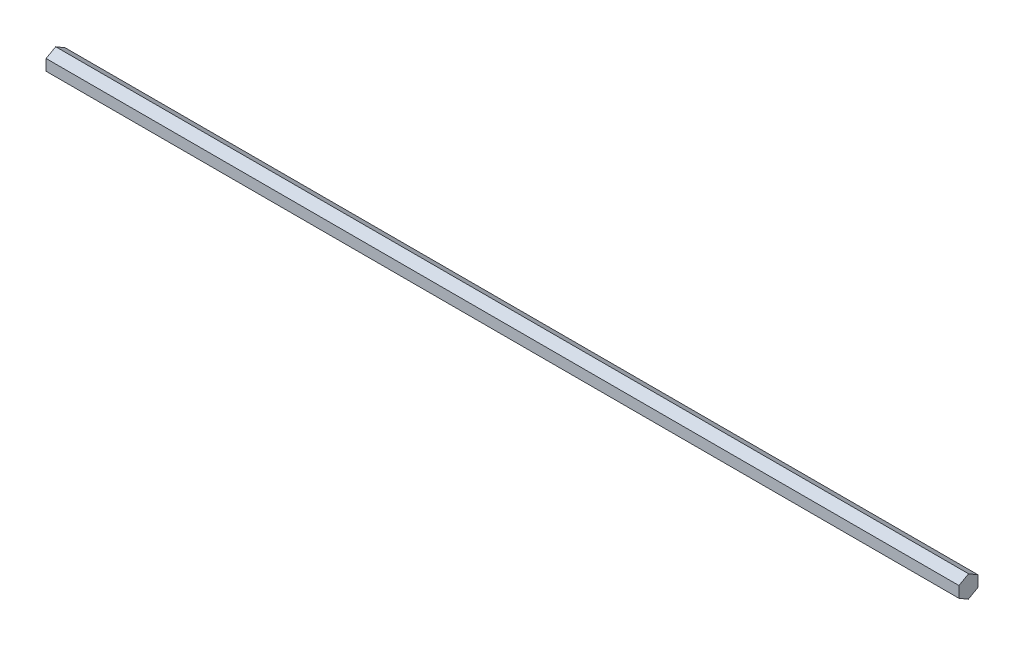
ISO-10303-21;
HEADER;
FILE_DESCRIPTION(('STEP AP214'),'2;1');
FILE_NAME('part.step','',(''),(''),'','','');
FILE_SCHEMA(('AUTOMOTIVE_DESIGN { 1 0 10303 214 1 1 1 1 }'));
ENDSEC;
DATA;
#1=APPLICATION_CONTEXT('core data for automotive mechanical design processes');
#2=APPLICATION_PROTOCOL_DEFINITION('international standard','automotive_design',2000,#1);
#3=PRODUCT_CONTEXT('',#1,'mechanical');
#4=PRODUCT('Part','Part','',(#3));
#5=PRODUCT_RELATED_PRODUCT_CATEGORY('part','',(#4));
#6=PRODUCT_DEFINITION_FORMATION('','',#4);
#7=PRODUCT_DEFINITION_CONTEXT('part definition',#1,'design');
#8=PRODUCT_DEFINITION('design','',#6,#7);
#9=PRODUCT_DEFINITION_SHAPE('','',#8);
#10=(LENGTH_UNIT() NAMED_UNIT(*) SI_UNIT(.MILLI.,.METRE.));
#11=(NAMED_UNIT(*) PLANE_ANGLE_UNIT() SI_UNIT($,.RADIAN.));
#12=(NAMED_UNIT(*) SI_UNIT($,.STERADIAN.) SOLID_ANGLE_UNIT());
#13=UNCERTAINTY_MEASURE_WITH_UNIT(LENGTH_MEASURE(1.E-05),#10,'distance_accuracy_value','');
#14=(GEOMETRIC_REPRESENTATION_CONTEXT(3) GLOBAL_UNCERTAINTY_ASSIGNED_CONTEXT((#13)) GLOBAL_UNIT_ASSIGNED_CONTEXT((#10,
#11,#12)) REPRESENTATION_CONTEXT('',''));
#15=CARTESIAN_POINT('',(0.,0.,0.));
#16=DIRECTION('',(0.,0.,1.));
#17=DIRECTION('',(1.,0.,0.));
#18=AXIS2_PLACEMENT_3D('',#15,#16,#17);
#19=CARTESIAN_POINT('',(609.6,-3.7307506345818,-6.31227637512022));
#20=DIRECTION('',(0.,0.0101995476622231,0.999947983260872));
#21=DIRECTION('',(0.,-0.999947983260872,0.0101995476622231));
#22=AXIS2_PLACEMENT_3D('',#19,#20,#21);
#23=PLANE('',#22);
#24=DIRECTION('',(0.,0.999947983260872,-0.0101995476622231));
#25=VECTOR('',#24,1.);
#26=CARTESIAN_POINT('',(0.,-3.7307506345818,-6.31227637512022));
#27=LINE('',#26,#25);
#28=CARTESIAN_POINT('',(0.,-3.7307506345818,-6.31227637512022));
#29=VERTEX_POINT('',#28);
#30=CARTESIAN_POINT('',(0.,3.60121637927156,-6.38706301229286));
#31=VERTEX_POINT('',#30);
#32=EDGE_CURVE('E116',#29,#31,#27,.T.);
#33=ORIENTED_EDGE('',*,*,#32,.T.);
#34=DIRECTION('',(-1.,0.,0.));
#35=VECTOR('',#34,1.);
#36=CARTESIAN_POINT('',(609.6,3.60121637927156,-6.38706301229286));
#37=LINE('',#36,#35);
#38=CARTESIAN_POINT('',(609.6,3.60121637927156,-6.38706301229286));
#39=VERTEX_POINT('',#38);
#40=EDGE_CURVE('E11',#39,#31,#37,.T.);
#41=ORIENTED_EDGE('',*,*,#40,.F.);
#42=DIRECTION('',(0.,0.999947983260872,-0.0101995476622231));
#43=VECTOR('',#42,1.);
#44=CARTESIAN_POINT('',(609.6,-3.7307506345818,-6.31227637512022));
#45=LINE('',#44,#43);
#46=CARTESIAN_POINT('',(609.6,-3.7307506345818,-6.31227637512022));
#47=VERTEX_POINT('',#46);
#48=EDGE_CURVE('E126',#47,#39,#45,.T.);
#49=ORIENTED_EDGE('',*,*,#48,.F.);
#50=DIRECTION('',(-1.,0.,0.));
#51=VECTOR('',#50,1.);
#52=CARTESIAN_POINT('',(609.6,-3.7307506345818,-6.31227637512022));
#53=LINE('',#52,#51);
#54=EDGE_CURVE('E112',#47,#29,#53,.T.);
#55=ORIENTED_EDGE('',*,*,#54,.T.);
#56=EDGE_LOOP('',(#33,#41,#49,#55));
#57=FACE_BOUND('',#56,.T.);
#58=ADVANCED_FACE('F32',(#57),#23,.F.);
#59=CARTESIAN_POINT('',(609.6,3.60121637927156,-6.38706301229286));
#60=DIRECTION('',(0.,-0.86088058213582,0.508807059013032));
#61=DIRECTION('',(0.,-0.508807059013032,-0.86088058213582));
#62=AXIS2_PLACEMENT_3D('',#59,#60,#61);
#63=PLANE('',#62);
#64=DIRECTION('',(0.,0.508807059013032,0.86088058213582));
#65=VECTOR('',#64,1.);
#66=CARTESIAN_POINT('',(0.,3.60121637927156,-6.38706301229286));
#67=LINE('',#66,#65);
#68=CARTESIAN_POINT('',(0.,7.33196701385336,-0.0747866371726431));
#69=VERTEX_POINT('',#68);
#70=EDGE_CURVE('E119',#31,#69,#67,.T.);
#71=ORIENTED_EDGE('',*,*,#70,.T.);
#72=DIRECTION('',(-1.,0.,0.));
#73=VECTOR('',#72,1.);
#74=CARTESIAN_POINT('',(609.6,7.33196701385336,-0.0747866371726431));
#75=LINE('',#74,#73);
#76=CARTESIAN_POINT('',(609.6,7.33196701385336,-0.0747866371726431));
#77=VERTEX_POINT('',#76);
#78=EDGE_CURVE('E40',#77,#69,#75,.T.);
#79=ORIENTED_EDGE('',*,*,#78,.F.);
#80=DIRECTION('',(0.,0.508807059013032,0.86088058213582));
#81=VECTOR('',#80,1.);
#82=CARTESIAN_POINT('',(609.6,3.60121637927156,-6.38706301229286));
#83=LINE('',#82,#81);
#84=EDGE_CURVE('E85',#39,#77,#83,.T.);
#85=ORIENTED_EDGE('',*,*,#84,.F.);
#86=ORIENTED_EDGE('',*,*,#40,.T.);
#87=EDGE_LOOP('',(#71,#79,#85,#86));
#88=FACE_BOUND('',#87,.T.);
#89=ADVANCED_FACE('F150',(#88),#63,.F.);
#90=CARTESIAN_POINT('',(609.6,7.33196701385336,-0.0747866371726431));
#91=DIRECTION('',(0.,-0.871080129798044,-0.491140924247841));
#92=DIRECTION('',(0.,0.491140924247841,-0.871080129798044));
#93=AXIS2_PLACEMENT_3D('',#90,#91,#92);
#94=PLANE('',#93);
#95=DIRECTION('',(0.,-0.49114092424784,0.871080129798044));
#96=VECTOR('',#95,1.);
#97=CARTESIAN_POINT('',(0.,7.33196701385336,-0.0747866371726431));
#98=LINE('',#97,#96);
#99=CARTESIAN_POINT('',(0.,3.7307506345818,6.31227637512022));
#100=VERTEX_POINT('',#99);
#101=EDGE_CURVE('E121',#69,#100,#98,.T.);
#102=ORIENTED_EDGE('',*,*,#101,.T.);
#103=DIRECTION('',(-1.,0.,0.));
#104=VECTOR('',#103,1.);
#105=CARTESIAN_POINT('',(609.6,3.7307506345818,6.31227637512022));
#106=LINE('',#105,#104);
#107=CARTESIAN_POINT('',(609.6,3.7307506345818,6.31227637512022));
#108=VERTEX_POINT('',#107);
#109=EDGE_CURVE('E107',#108,#100,#106,.T.);
#110=ORIENTED_EDGE('',*,*,#109,.F.);
#111=DIRECTION('',(0.,-0.49114092424784,0.871080129798044));
#112=VECTOR('',#111,1.);
#113=CARTESIAN_POINT('',(609.6,7.33196701385336,-0.0747866371726431));
#114=LINE('',#113,#112);
#115=EDGE_CURVE('E98',#77,#108,#114,.T.);
#116=ORIENTED_EDGE('',*,*,#115,.F.);
#117=ORIENTED_EDGE('',*,*,#78,.T.);
#118=EDGE_LOOP('',(#102,#110,#116,#117));
#119=FACE_BOUND('',#118,.T.);
#120=ADVANCED_FACE('F132',(#119),#94,.F.);
#121=CARTESIAN_POINT('',(609.6,3.7307506345818,6.31227637512022));
#122=DIRECTION('',(0.,-0.0101995476622233,-0.999947983260872));
#123=DIRECTION('',(0.,0.999947983260873,-0.0101995476622233));
#124=AXIS2_PLACEMENT_3D('',#121,#122,#123);
#125=PLANE('',#124);
#126=DIRECTION('',(0.,-0.999947983260873,0.0101995476622233));
#127=VECTOR('',#126,1.);
#128=CARTESIAN_POINT('',(0.,3.7307506345818,6.31227637512022));
#129=LINE('',#128,#127);
#130=CARTESIAN_POINT('',(0.,-3.60121637927156,6.38706301229286));
#131=VERTEX_POINT('',#130);
#132=EDGE_CURVE('E106',#100,#131,#129,.T.);
#133=ORIENTED_EDGE('',*,*,#132,.T.);
#134=DIRECTION('',(-1.,0.,0.));
#135=VECTOR('',#134,1.);
#136=CARTESIAN_POINT('',(609.6,-3.60121637927156,6.38706301229286));
#137=LINE('',#136,#135);
#138=CARTESIAN_POINT('',(609.6,-3.60121637927156,6.38706301229286));
#139=VERTEX_POINT('',#138);
#140=EDGE_CURVE('E103',#139,#131,#137,.T.);
#141=ORIENTED_EDGE('',*,*,#140,.F.);
#142=DIRECTION('',(0.,-0.999947983260873,0.0101995476622233));
#143=VECTOR('',#142,1.);
#144=CARTESIAN_POINT('',(609.6,3.7307506345818,6.31227637512022));
#145=LINE('',#144,#143);
#146=EDGE_CURVE('E92',#108,#139,#145,.T.);
#147=ORIENTED_EDGE('',*,*,#146,.F.);
#148=ORIENTED_EDGE('',*,*,#109,.T.);
#149=EDGE_LOOP('',(#133,#141,#147,#148));
#150=FACE_BOUND('',#149,.T.);
#151=ADVANCED_FACE('F104',(#150),#125,.F.);
#152=CARTESIAN_POINT('',(609.6,-3.60121637927156,6.38706301229286));
#153=DIRECTION('',(0.,0.860880582135821,-0.508807059013032));
#154=DIRECTION('',(0.,0.508807059013032,0.860880582135821));
#155=AXIS2_PLACEMENT_3D('',#152,#153,#154);
#156=PLANE('',#155);
#157=DIRECTION('',(0.,-0.508807059013032,-0.86088058213582));
#158=VECTOR('',#157,1.);
#159=CARTESIAN_POINT('',(0.,-3.60121637927156,6.38706301229286));
#160=LINE('',#159,#158);
#161=CARTESIAN_POINT('',(0.,-7.33196701385336,0.0747866371726409));
#162=VERTEX_POINT('',#161);
#163=EDGE_CURVE('E71',#131,#162,#160,.T.);
#164=ORIENTED_EDGE('',*,*,#163,.T.);
#165=DIRECTION('',(-1.,0.,0.));
#166=VECTOR('',#165,1.);
#167=CARTESIAN_POINT('',(609.6,-7.33196701385336,0.0747866371726409));
#168=LINE('',#167,#166);
#169=CARTESIAN_POINT('',(609.6,-7.33196701385336,0.0747866371726409));
#170=VERTEX_POINT('',#169);
#171=EDGE_CURVE('E108',#170,#162,#168,.T.);
#172=ORIENTED_EDGE('',*,*,#171,.F.);
#173=DIRECTION('',(0.,-0.508807059013032,-0.86088058213582));
#174=VECTOR('',#173,1.);
#175=CARTESIAN_POINT('',(609.6,-3.60121637927156,6.38706301229286));
#176=LINE('',#175,#174);
#177=EDGE_CURVE('E96',#139,#170,#176,.T.);
#178=ORIENTED_EDGE('',*,*,#177,.F.);
#179=ORIENTED_EDGE('',*,*,#140,.T.);
#180=EDGE_LOOP('',(#164,#172,#178,#179));
#181=FACE_BOUND('',#180,.T.);
#182=ADVANCED_FACE('F110',(#181),#156,.F.);
#183=CARTESIAN_POINT('',(609.6,-7.33196701385336,0.0747866371726409));
#184=DIRECTION('',(0.,0.871080129798044,0.49114092424784));
#185=DIRECTION('',(0.,-0.49114092424784,0.871080129798044));
#186=AXIS2_PLACEMENT_3D('',#183,#184,#185);
#187=PLANE('',#186);
#188=DIRECTION('',(0.,0.49114092424784,-0.871080129798044));
#189=VECTOR('',#188,1.);
#190=CARTESIAN_POINT('',(0.,-7.33196701385336,0.0747866371726409));
#191=LINE('',#190,#189);
#192=EDGE_CURVE('E77',#162,#29,#191,.T.);
#193=ORIENTED_EDGE('',*,*,#192,.T.);
#194=ORIENTED_EDGE('',*,*,#54,.F.);
#195=DIRECTION('',(0.,0.49114092424784,-0.871080129798044));
#196=VECTOR('',#195,1.);
#197=CARTESIAN_POINT('',(609.6,-7.33196701385336,0.0747866371726409));
#198=LINE('',#197,#196);
#199=EDGE_CURVE('E48',#170,#47,#198,.T.);
#200=ORIENTED_EDGE('',*,*,#199,.F.);
#201=ORIENTED_EDGE('',*,*,#171,.T.);
#202=EDGE_LOOP('',(#193,#194,#200,#201));
#203=FACE_BOUND('',#202,.T.);
#204=ADVANCED_FACE('F139',(#203),#187,.F.);
#205=CARTESIAN_POINT('',(609.6,0.,0.));
#206=DIRECTION('',(1.,0.,0.));
#207=DIRECTION('',(0.,0.,-1.));
#208=AXIS2_PLACEMENT_3D('',#205,#206,#207);
#209=PLANE('',#208);
#210=ORIENTED_EDGE('',*,*,#48,.T.);
#211=ORIENTED_EDGE('',*,*,#84,.T.);
#212=ORIENTED_EDGE('',*,*,#115,.T.);
#213=ORIENTED_EDGE('',*,*,#146,.T.);
#214=ORIENTED_EDGE('',*,*,#177,.T.);
#215=ORIENTED_EDGE('',*,*,#199,.T.);
#216=EDGE_LOOP('',(#210,#211,#212,#213,#214,#215));
#217=FACE_BOUND('',#216,.T.);
#218=ADVANCED_FACE('F94',(#217),#209,.T.);
#219=CARTESIAN_POINT('',(0.,0.,0.));
#220=DIRECTION('',(1.,0.,0.));
#221=DIRECTION('',(0.,0.,-1.));
#222=AXIS2_PLACEMENT_3D('',#219,#220,#221);
#223=PLANE('',#222);
#224=ORIENTED_EDGE('',*,*,#32,.F.);
#225=ORIENTED_EDGE('',*,*,#192,.F.);
#226=ORIENTED_EDGE('',*,*,#163,.F.);
#227=ORIENTED_EDGE('',*,*,#132,.F.);
#228=ORIENTED_EDGE('',*,*,#101,.F.);
#229=ORIENTED_EDGE('',*,*,#70,.F.);
#230=EDGE_LOOP('',(#224,#225,#226,#227,#228,#229));
#231=FACE_BOUND('',#230,.T.);
#232=ADVANCED_FACE('F135',(#231),#223,.F.);
#233=CLOSED_SHELL('',(#58,#89,#120,#151,#182,#204,#218,#232));
#234=MANIFOLD_SOLID_BREP('B2',#233);
#235=ADVANCED_BREP_SHAPE_REPRESENTATION('',(#18,#234),#14);
#236=SHAPE_DEFINITION_REPRESENTATION(#9,#235);
ENDSEC;
END-ISO-10303-21;
